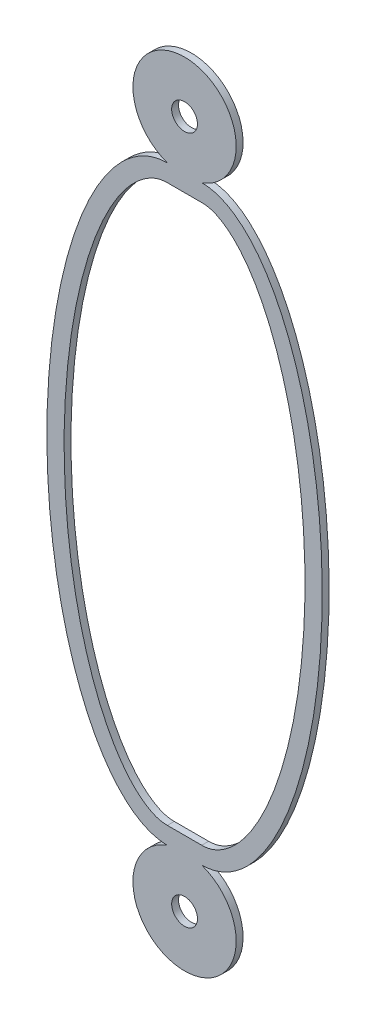
ISO-10303-21;
HEADER;
FILE_DESCRIPTION(('STEP AP214'),'2;1');
FILE_NAME('part.step','',(''),(''),'','','');
FILE_SCHEMA(('AUTOMOTIVE_DESIGN { 1 0 10303 214 1 1 1 1 }'));
ENDSEC;
DATA;
#1=APPLICATION_CONTEXT('core data for automotive mechanical design processes');
#2=APPLICATION_PROTOCOL_DEFINITION('international standard','automotive_design',2000,#1);
#3=PRODUCT_CONTEXT('',#1,'mechanical');
#4=PRODUCT('Part','Part','',(#3));
#5=PRODUCT_RELATED_PRODUCT_CATEGORY('part','',(#4));
#6=PRODUCT_DEFINITION_FORMATION('','',#4);
#7=PRODUCT_DEFINITION_CONTEXT('part definition',#1,'design');
#8=PRODUCT_DEFINITION('design','',#6,#7);
#9=PRODUCT_DEFINITION_SHAPE('','',#8);
#10=(LENGTH_UNIT() NAMED_UNIT(*) SI_UNIT(.MILLI.,.METRE.));
#11=(NAMED_UNIT(*) PLANE_ANGLE_UNIT() SI_UNIT($,.RADIAN.));
#12=(NAMED_UNIT(*) SI_UNIT($,.STERADIAN.) SOLID_ANGLE_UNIT());
#13=UNCERTAINTY_MEASURE_WITH_UNIT(LENGTH_MEASURE(1.E-05),#10,'distance_accuracy_value','');
#14=(GEOMETRIC_REPRESENTATION_CONTEXT(3) GLOBAL_UNCERTAINTY_ASSIGNED_CONTEXT((#13)) GLOBAL_UNIT_ASSIGNED_CONTEXT((#10,
#11,#12)) REPRESENTATION_CONTEXT('',''));
#15=CARTESIAN_POINT('',(0.,0.,0.));
#16=DIRECTION('',(0.,0.,1.));
#17=DIRECTION('',(1.,0.,0.));
#18=AXIS2_PLACEMENT_3D('',#15,#16,#17);
#19=CARTESIAN_POINT('',(-0.500000000000001,0.,0.1));
#20=DIRECTION('',(0.,0.,1.));
#21=DIRECTION('',(1.,0.,0.));
#22=AXIS2_PLACEMENT_3D('',#19,#20,#21);
#23=PLANE('',#22);
#24=CARTESIAN_POINT('',(0.,10.,0.1));
#25=DIRECTION('',(0.,0.,1.));
#26=DIRECTION('',(1.,0.,0.));
#27=AXIS2_PLACEMENT_3D('',#24,#25,#26);
#28=CIRCLE('',#27,0.375000000000001);
#29=CARTESIAN_POINT('',(0.375,10.,0.1));
#30=VERTEX_POINT('',#29);
#31=EDGE_CURVE('E182',#30,#30,#28,.T.);
#32=ORIENTED_EDGE('',*,*,#31,.F.);
#33=EDGE_LOOP('',(#32));
#34=FACE_BOUND('',#33,.T.);
#35=CARTESIAN_POINT('',(-0.500000000000001,0.,0.1));
#36=DIRECTION('',(0.,0.,1.));
#37=DIRECTION('',(0.,1.,0.));
#38=AXIS2_PLACEMENT_3D('',#35,#36,#37);
#39=ELLIPSE('',#38,8.5857864376269,3.5);
#40=CARTESIAN_POINT('',(-0.500000000000002,8.5857864376269,0.1));
#41=VERTEX_POINT('',#40);
#42=CARTESIAN_POINT('',(-0.500000000000001,-8.5857864376269,0.1));
#43=VERTEX_POINT('',#42);
#44=EDGE_CURVE('E188',#41,#43,#39,.T.);
#45=ORIENTED_EDGE('',*,*,#44,.T.);
#46=CARTESIAN_POINT('',(0.,-10.,0.1));
#47=DIRECTION('',(0.,0.,1.));
#48=DIRECTION('',(1.,0.,0.));
#49=AXIS2_PLACEMENT_3D('',#46,#47,#48);
#50=CIRCLE('',#49,1.5);
#51=CARTESIAN_POINT('',(0.499999999999999,-8.5857864376269,0.1));
#52=VERTEX_POINT('',#51);
#53=EDGE_CURVE('E175',#43,#52,#50,.T.);
#54=ORIENTED_EDGE('',*,*,#53,.T.);
#55=CARTESIAN_POINT('',(0.499999999999999,0.,0.1));
#56=DIRECTION('',(0.,0.,1.));
#57=DIRECTION('',(0.,1.,0.));
#58=AXIS2_PLACEMENT_3D('',#55,#56,#57);
#59=ELLIPSE('',#58,8.5857864376269,3.5);
#60=CARTESIAN_POINT('',(0.499999999999999,8.5857864376269,0.1));
#61=VERTEX_POINT('',#60);
#62=EDGE_CURVE('E170',#52,#61,#59,.T.);
#63=ORIENTED_EDGE('',*,*,#62,.T.);
#64=CARTESIAN_POINT('',(0.,10.,0.1));
#65=DIRECTION('',(0.,0.,1.));
#66=DIRECTION('',(1.,0.,0.));
#67=AXIS2_PLACEMENT_3D('',#64,#65,#66);
#68=CIRCLE('',#67,1.5);
#69=EDGE_CURVE('E174',#61,#41,#68,.T.);
#70=ORIENTED_EDGE('',*,*,#69,.T.);
#71=EDGE_LOOP('',(#45,#54,#63,#70));
#72=FACE_BOUND('',#71,.T.);
#73=CARTESIAN_POINT('',(0.,-10.,0.1));
#74=DIRECTION('',(0.,0.,1.));
#75=DIRECTION('',(1.,0.,0.));
#76=AXIS2_PLACEMENT_3D('',#73,#74,#75);
#77=CIRCLE('',#76,0.375);
#78=CARTESIAN_POINT('',(0.375000000000006,-10.,0.1));
#79=VERTEX_POINT('',#78);
#80=EDGE_CURVE('E215',#79,#79,#77,.T.);
#81=ORIENTED_EDGE('',*,*,#80,.F.);
#82=EDGE_LOOP('',(#81));
#83=FACE_BOUND('',#82,.T.);
#84=DIRECTION('',(1.,0.,0.));
#85=VECTOR('',#84,1.);
#86=CARTESIAN_POINT('',(-0.500000000000001,-8.08578643762691,0.1));
#87=LINE('',#86,#85);
#88=CARTESIAN_POINT('',(-0.500000000000001,-8.08578643762691,0.1));
#89=VERTEX_POINT('',#88);
#90=CARTESIAN_POINT('',(0.5,-8.0857864376269,0.1));
#91=VERTEX_POINT('',#90);
#92=EDGE_CURVE('E108',#89,#91,#87,.T.);
#93=ORIENTED_EDGE('',*,*,#92,.F.);
#94=CARTESIAN_POINT('',(-0.500000000000001,8.0857864376269,0.1));
#95=CARTESIAN_POINT('',(-0.659147925726962,8.0857864376269,0.1));
#96=CARTESIAN_POINT('',(-0.94590993674264,8.01836726312393,0.1));
#97=CARTESIAN_POINT('',(-1.48190681272366,7.63575974394931,0.1));
#98=CARTESIAN_POINT('',(-2.02462270649366,6.92767469065392,0.1));
#99=CARTESIAN_POINT('',(-2.69255409919081,5.58946200738258,0.1));
#100=CARTESIAN_POINT('',(-3.32190291475356,3.2913111898813,0.1));
#101=CARTESIAN_POINT('',(-3.58904854262322,0.,0.1));
#102=CARTESIAN_POINT('',(-3.32190291475355,-3.2913111898813,0.1));
#103=CARTESIAN_POINT('',(-2.69255409919081,-5.58946200738258,0.1));
#104=CARTESIAN_POINT('',(-2.02462270649366,-6.92767469065392,0.1));
#105=CARTESIAN_POINT('',(-1.48190681272366,-7.63575974394932,0.1));
#106=CARTESIAN_POINT('',(-0.945909936742641,-8.01836726312393,0.1));
#107=CARTESIAN_POINT('',(-0.659147925726963,-8.08578643762691,0.1));
#108=CARTESIAN_POINT('',(-0.500000000000001,-8.08578643762691,0.1));
#109=B_SPLINE_CURVE_WITH_KNOTS('',3,(#94,#95,#96,#97,#98,#99,#100,#101,#102,#103,#104,#105,#106,
#107,#108),.UNSPECIFIED.,.F.,.F.,(4,1,1,1,1,1,1,1,1,1,1,1,4),(0.,0.196349540849362,
0.392699081698724,0.589048622548086,0.785398163397448,1.17809724509617,1.5707963267949,
1.96349540849362,2.35619449019234,2.55254403104171,2.74889357189107,2.94524311274043,
3.14159265358979),.UNSPECIFIED.);
#110=CARTESIAN_POINT('',(-0.500000000000001,8.0857864376269,0.1));
#111=VERTEX_POINT('',#110);
#112=EDGE_CURVE('E100',#111,#89,#109,.T.);
#113=ORIENTED_EDGE('',*,*,#112,.F.);
#114=DIRECTION('',(-1.,0.,0.));
#115=VECTOR('',#114,1.);
#116=CARTESIAN_POINT('',(-0.500000000000001,8.0857864376269,0.1));
#117=LINE('',#116,#115);
#118=CARTESIAN_POINT('',(0.5,8.0857864376269,0.1));
#119=VERTEX_POINT('',#118);
#120=EDGE_CURVE('E122',#119,#111,#117,.T.);
#121=ORIENTED_EDGE('',*,*,#120,.F.);
#122=CARTESIAN_POINT('',(0.5,-8.0857864376269,0.1));
#123=CARTESIAN_POINT('',(0.659147925726961,-8.0857864376269,0.1));
#124=CARTESIAN_POINT('',(0.94590993674264,-8.01836726312392,0.1));
#125=CARTESIAN_POINT('',(1.48190681272366,-7.63575974394931,0.1));
#126=CARTESIAN_POINT('',(2.02462270649366,-6.92767469065392,0.1));
#127=CARTESIAN_POINT('',(2.69255409919081,-5.58946200738257,0.1));
#128=CARTESIAN_POINT('',(3.32190291475355,-3.2913111898813,0.1));
#129=CARTESIAN_POINT('',(3.58904854262322,0.,0.1));
#130=CARTESIAN_POINT('',(3.32190291475355,3.2913111898813,0.1));
#131=CARTESIAN_POINT('',(2.6925540991908,5.58946200738258,0.1));
#132=CARTESIAN_POINT('',(2.02462270649366,6.92767469065392,0.1));
#133=CARTESIAN_POINT('',(1.48190681272366,7.63575974394931,0.1));
#134=CARTESIAN_POINT('',(0.945909936742639,8.01836726312393,0.1));
#135=CARTESIAN_POINT('',(0.659147925726961,8.0857864376269,0.1));
#136=CARTESIAN_POINT('',(0.499999999999999,8.0857864376269,0.1));
#137=B_SPLINE_CURVE_WITH_KNOTS('',3,(#122,#123,#124,#125,#126,#127,#128,#129,#130,#131,#132,
#133,#134,#135,#136),.UNSPECIFIED.,.F.,.F.,(4,1,1,1,1,1,1,1,1,1,1,1,4),(-3.14159265358979,
-2.94524311274043,-2.74889357189107,-2.55254403104171,-2.35619449019234,-1.96349540849362,
-1.5707963267949,-1.17809724509617,-0.785398163397448,-0.589048622548086,-0.392699081698724,
-0.196349540849362,0.),.UNSPECIFIED.);
#138=EDGE_CURVE('E120',#91,#119,#137,.T.);
#139=ORIENTED_EDGE('',*,*,#138,.F.);
#140=EDGE_LOOP('',(#93,#113,#121,#139));
#141=FACE_BOUND('',#140,.T.);
#142=ADVANCED_FACE('F34',(#34,#72,#83,#141),#23,.T.);
#143=CARTESIAN_POINT('',(-0.500000000000001,0.,-0.1));
#144=DIRECTION('',(0.,0.,1.));
#145=DIRECTION('',(1.,0.,0.));
#146=AXIS2_PLACEMENT_3D('',#143,#144,#145);
#147=PLANE('',#146);
#148=CARTESIAN_POINT('',(0.,-10.,-0.1));
#149=DIRECTION('',(0.,0.,1.));
#150=DIRECTION('',(1.,0.,0.));
#151=AXIS2_PLACEMENT_3D('',#148,#149,#150);
#152=CIRCLE('',#151,0.375);
#153=CARTESIAN_POINT('',(0.375000000000006,-10.,-0.1));
#154=VERTEX_POINT('',#153);
#155=EDGE_CURVE('E116',#154,#154,#152,.T.);
#156=ORIENTED_EDGE('',*,*,#155,.T.);
#157=EDGE_LOOP('',(#156));
#158=FACE_BOUND('',#157,.T.);
#159=CARTESIAN_POINT('',(0.,10.,-0.1));
#160=DIRECTION('',(0.,0.,1.));
#161=DIRECTION('',(1.,0.,0.));
#162=AXIS2_PLACEMENT_3D('',#159,#160,#161);
#163=CIRCLE('',#162,0.375000000000001);
#164=CARTESIAN_POINT('',(0.375,10.,-0.1));
#165=VERTEX_POINT('',#164);
#166=EDGE_CURVE('E212',#165,#165,#163,.T.);
#167=ORIENTED_EDGE('',*,*,#166,.T.);
#168=EDGE_LOOP('',(#167));
#169=FACE_BOUND('',#168,.T.);
#170=CARTESIAN_POINT('',(-0.500000000000001,0.,-0.1));
#171=DIRECTION('',(0.,0.,1.));
#172=DIRECTION('',(0.,1.,0.));
#173=AXIS2_PLACEMENT_3D('',#170,#171,#172);
#174=ELLIPSE('',#173,8.5857864376269,3.5);
#175=CARTESIAN_POINT('',(-0.500000000000002,8.5857864376269,-0.1));
#176=VERTEX_POINT('',#175);
#177=CARTESIAN_POINT('',(-0.500000000000001,-8.5857864376269,-0.1));
#178=VERTEX_POINT('',#177);
#179=EDGE_CURVE('E178',#176,#178,#174,.T.);
#180=ORIENTED_EDGE('',*,*,#179,.F.);
#181=CARTESIAN_POINT('',(0.,10.,-0.1));
#182=DIRECTION('',(0.,0.,1.));
#183=DIRECTION('',(1.,0.,0.));
#184=AXIS2_PLACEMENT_3D('',#181,#182,#183);
#185=CIRCLE('',#184,1.5);
#186=CARTESIAN_POINT('',(0.499999999999999,8.5857864376269,-0.1));
#187=VERTEX_POINT('',#186);
#188=EDGE_CURVE('E186',#187,#176,#185,.T.);
#189=ORIENTED_EDGE('',*,*,#188,.F.);
#190=CARTESIAN_POINT('',(0.499999999999999,0.,-0.1));
#191=DIRECTION('',(0.,0.,1.));
#192=DIRECTION('',(0.,1.,0.));
#193=AXIS2_PLACEMENT_3D('',#190,#191,#192);
#194=ELLIPSE('',#193,8.5857864376269,3.5);
#195=CARTESIAN_POINT('',(0.499999999999999,-8.5857864376269,-0.1));
#196=VERTEX_POINT('',#195);
#197=EDGE_CURVE('E184',#196,#187,#194,.T.);
#198=ORIENTED_EDGE('',*,*,#197,.F.);
#199=CARTESIAN_POINT('',(0.,-10.,-0.1));
#200=DIRECTION('',(0.,0.,1.));
#201=DIRECTION('',(1.,0.,0.));
#202=AXIS2_PLACEMENT_3D('',#199,#200,#201);
#203=CIRCLE('',#202,1.5);
#204=EDGE_CURVE('E181',#178,#196,#203,.T.);
#205=ORIENTED_EDGE('',*,*,#204,.F.);
#206=EDGE_LOOP('',(#180,#189,#198,#205));
#207=FACE_BOUND('',#206,.T.);
#208=CARTESIAN_POINT('',(-0.500000000000001,8.0857864376269,-0.1));
#209=CARTESIAN_POINT('',(-0.659147925726962,8.0857864376269,-0.1));
#210=CARTESIAN_POINT('',(-0.94590993674264,8.01836726312393,-0.1));
#211=CARTESIAN_POINT('',(-1.48190681272366,7.63575974394931,-0.1));
#212=CARTESIAN_POINT('',(-2.02462270649366,6.92767469065392,-0.1));
#213=CARTESIAN_POINT('',(-2.69255409919081,5.58946200738258,-0.1));
#214=CARTESIAN_POINT('',(-3.32190291475356,3.2913111898813,-0.1));
#215=CARTESIAN_POINT('',(-3.58904854262322,0.,-0.1));
#216=CARTESIAN_POINT('',(-3.32190291475355,-3.2913111898813,-0.1));
#217=CARTESIAN_POINT('',(-2.69255409919081,-5.58946200738258,-0.1));
#218=CARTESIAN_POINT('',(-2.02462270649366,-6.92767469065392,-0.1));
#219=CARTESIAN_POINT('',(-1.48190681272366,-7.63575974394932,-0.1));
#220=CARTESIAN_POINT('',(-0.945909936742641,-8.01836726312393,-0.1));
#221=CARTESIAN_POINT('',(-0.659147925726963,-8.08578643762691,-0.1));
#222=CARTESIAN_POINT('',(-0.500000000000001,-8.08578643762691,-0.1));
#223=B_SPLINE_CURVE_WITH_KNOTS('',3,(#208,#209,#210,#211,#212,#213,#214,#215,#216,#217,#218,
#219,#220,#221,#222),.UNSPECIFIED.,.F.,.F.,(4,1,1,1,1,1,1,1,1,1,1,1,4),(0.,0.196349540849362,
0.392699081698724,0.589048622548086,0.785398163397448,1.17809724509617,1.5707963267949,
1.96349540849362,2.35619449019234,2.55254403104171,2.74889357189107,2.94524311274043,
3.14159265358979),.UNSPECIFIED.);
#224=CARTESIAN_POINT('',(-0.500000000000001,8.0857864376269,-0.1));
#225=VERTEX_POINT('',#224);
#226=CARTESIAN_POINT('',(-0.500000000000001,-8.08578643762691,-0.1));
#227=VERTEX_POINT('',#226);
#228=EDGE_CURVE('E58',#225,#227,#223,.T.);
#229=ORIENTED_EDGE('',*,*,#228,.T.);
#230=DIRECTION('',(1.,0.,0.));
#231=VECTOR('',#230,1.);
#232=CARTESIAN_POINT('',(-0.500000000000001,-8.08578643762691,-0.1));
#233=LINE('',#232,#231);
#234=CARTESIAN_POINT('',(0.5,-8.0857864376269,-0.1));
#235=VERTEX_POINT('',#234);
#236=EDGE_CURVE('E115',#227,#235,#233,.T.);
#237=ORIENTED_EDGE('',*,*,#236,.T.);
#238=CARTESIAN_POINT('',(0.5,-8.0857864376269,-0.1));
#239=CARTESIAN_POINT('',(0.659147925726961,-8.0857864376269,-0.1));
#240=CARTESIAN_POINT('',(0.94590993674264,-8.01836726312392,-0.1));
#241=CARTESIAN_POINT('',(1.48190681272366,-7.63575974394931,-0.1));
#242=CARTESIAN_POINT('',(2.02462270649366,-6.92767469065392,-0.1));
#243=CARTESIAN_POINT('',(2.69255409919081,-5.58946200738257,-0.1));
#244=CARTESIAN_POINT('',(3.32190291475355,-3.2913111898813,-0.1));
#245=CARTESIAN_POINT('',(3.58904854262322,0.,-0.1));
#246=CARTESIAN_POINT('',(3.32190291475355,3.2913111898813,-0.1));
#247=CARTESIAN_POINT('',(2.6925540991908,5.58946200738258,-0.1));
#248=CARTESIAN_POINT('',(2.02462270649366,6.92767469065392,-0.1));
#249=CARTESIAN_POINT('',(1.48190681272366,7.63575974394931,-0.1));
#250=CARTESIAN_POINT('',(0.945909936742639,8.01836726312393,-0.1));
#251=CARTESIAN_POINT('',(0.659147925726961,8.0857864376269,-0.1));
#252=CARTESIAN_POINT('',(0.499999999999999,8.0857864376269,-0.1));
#253=B_SPLINE_CURVE_WITH_KNOTS('',3,(#238,#239,#240,#241,#242,#243,#244,#245,#246,#247,#248,
#249,#250,#251,#252),.UNSPECIFIED.,.F.,.F.,(4,1,1,1,1,1,1,1,1,1,1,1,4),(-3.14159265358979,
-2.94524311274043,-2.74889357189107,-2.55254403104171,-2.35619449019234,-1.96349540849362,
-1.5707963267949,-1.17809724509617,-0.785398163397448,-0.589048622548086,-0.392699081698724,
-0.196349540849362,0.),.UNSPECIFIED.);
#254=CARTESIAN_POINT('',(0.499999999999999,8.0857864376269,-0.1));
#255=VERTEX_POINT('',#254);
#256=EDGE_CURVE('E227',#235,#255,#253,.T.);
#257=ORIENTED_EDGE('',*,*,#256,.T.);
#258=DIRECTION('',(-1.,0.,0.));
#259=VECTOR('',#258,1.);
#260=CARTESIAN_POINT('',(-0.500000000000001,8.0857864376269,-0.1));
#261=LINE('',#260,#259);
#262=EDGE_CURVE('E109',#255,#225,#261,.T.);
#263=ORIENTED_EDGE('',*,*,#262,.T.);
#264=EDGE_LOOP('',(#229,#237,#257,#263));
#265=FACE_BOUND('',#264,.T.);
#266=ADVANCED_FACE('F157',(#158,#169,#207,#265),#147,.F.);
#267=DIRECTION('',(0.,0.,-1.));
#268=VECTOR('',#267,1.);
#269=SURFACE_OF_LINEAR_EXTRUSION('',#39,#268);
#270=ORIENTED_EDGE('',*,*,#179,.T.);
#271=DIRECTION('',(0.,0.,-1.));
#272=VECTOR('',#271,1.);
#273=CARTESIAN_POINT('',(-0.500000000000001,-8.5857864376269,0.1));
#274=LINE('',#273,#272);
#275=EDGE_CURVE('E11',#43,#178,#274,.T.);
#276=ORIENTED_EDGE('',*,*,#275,.F.);
#277=ORIENTED_EDGE('',*,*,#44,.F.);
#278=DIRECTION('',(0.,0.,-1.));
#279=VECTOR('',#278,1.);
#280=CARTESIAN_POINT('',(-0.500000000000002,8.5857864376269,0.1));
#281=LINE('',#280,#279);
#282=EDGE_CURVE('E177',#41,#176,#281,.T.);
#283=ORIENTED_EDGE('',*,*,#282,.T.);
#284=EDGE_LOOP('',(#270,#276,#277,#283));
#285=FACE_BOUND('',#284,.T.);
#286=ADVANCED_FACE('F36',(#285),#269,.F.);
#287=CARTESIAN_POINT('',(0.,-10.,0.1));
#288=DIRECTION('',(0.,0.,-1.));
#289=DIRECTION('',(-1.,0.,0.));
#290=AXIS2_PLACEMENT_3D('',#287,#288,#289);
#291=CYLINDRICAL_SURFACE('',#290,1.5);
#292=ORIENTED_EDGE('',*,*,#204,.T.);
#293=DIRECTION('',(0.,0.,-1.));
#294=VECTOR('',#293,1.);
#295=CARTESIAN_POINT('',(0.499999999999999,-8.5857864376269,0.1));
#296=LINE('',#295,#294);
#297=EDGE_CURVE('E43',#52,#196,#296,.T.);
#298=ORIENTED_EDGE('',*,*,#297,.F.);
#299=ORIENTED_EDGE('',*,*,#53,.F.);
#300=ORIENTED_EDGE('',*,*,#275,.T.);
#301=EDGE_LOOP('',(#292,#298,#299,#300));
#302=FACE_BOUND('',#301,.T.);
#303=ADVANCED_FACE('F168',(#302),#291,.T.);
#304=DIRECTION('',(0.,0.,-1.));
#305=VECTOR('',#304,1.);
#306=SURFACE_OF_LINEAR_EXTRUSION('',#59,#305);
#307=ORIENTED_EDGE('',*,*,#197,.T.);
#308=DIRECTION('',(0.,0.,-1.));
#309=VECTOR('',#308,1.);
#310=CARTESIAN_POINT('',(0.499999999999999,8.5857864376269,0.1));
#311=LINE('',#310,#309);
#312=EDGE_CURVE('E191',#61,#187,#311,.T.);
#313=ORIENTED_EDGE('',*,*,#312,.F.);
#314=ORIENTED_EDGE('',*,*,#62,.F.);
#315=ORIENTED_EDGE('',*,*,#297,.T.);
#316=EDGE_LOOP('',(#307,#313,#314,#315));
#317=FACE_BOUND('',#316,.T.);
#318=ADVANCED_FACE('F164',(#317),#306,.F.);
#319=CARTESIAN_POINT('',(0.,10.,0.1));
#320=DIRECTION('',(0.,0.,-1.));
#321=DIRECTION('',(-1.,0.,0.));
#322=AXIS2_PLACEMENT_3D('',#319,#320,#321);
#323=CYLINDRICAL_SURFACE('',#322,1.5);
#324=ORIENTED_EDGE('',*,*,#188,.T.);
#325=ORIENTED_EDGE('',*,*,#282,.F.);
#326=ORIENTED_EDGE('',*,*,#69,.F.);
#327=ORIENTED_EDGE('',*,*,#312,.T.);
#328=EDGE_LOOP('',(#324,#325,#326,#327));
#329=FACE_BOUND('',#328,.T.);
#330=ADVANCED_FACE('F153',(#329),#323,.T.);
#331=CARTESIAN_POINT('',(0.,10.,0.1));
#332=DIRECTION('',(0.,0.,-1.));
#333=DIRECTION('',(-1.,0.,0.));
#334=AXIS2_PLACEMENT_3D('',#331,#332,#333);
#335=CYLINDRICAL_SURFACE('',#334,0.375000000000001);
#336=ORIENTED_EDGE('',*,*,#31,.T.);
#337=EDGE_LOOP('',(#336));
#338=FACE_BOUND('',#337,.T.);
#339=ORIENTED_EDGE('',*,*,#166,.F.);
#340=EDGE_LOOP('',(#339));
#341=FACE_BOUND('',#340,.T.);
#342=ADVANCED_FACE('F149',(#338,#341),#335,.F.);
#343=CARTESIAN_POINT('',(0.,-10.,0.1));
#344=DIRECTION('',(0.,0.,-1.));
#345=DIRECTION('',(-1.,0.,0.));
#346=AXIS2_PLACEMENT_3D('',#343,#344,#345);
#347=CYLINDRICAL_SURFACE('',#346,0.375);
#348=ORIENTED_EDGE('',*,*,#80,.T.);
#349=EDGE_LOOP('',(#348));
#350=FACE_BOUND('',#349,.T.);
#351=ORIENTED_EDGE('',*,*,#155,.F.);
#352=EDGE_LOOP('',(#351));
#353=FACE_BOUND('',#352,.T.);
#354=ADVANCED_FACE('F146',(#350,#353),#347,.F.);
#355=DIRECTION('',(0.,0.,-1.));
#356=VECTOR('',#355,1.);
#357=SURFACE_OF_LINEAR_EXTRUSION('',#109,#356);
#358=ORIENTED_EDGE('',*,*,#228,.F.);
#359=DIRECTION('',(0.,0.,-1.));
#360=VECTOR('',#359,1.);
#361=CARTESIAN_POINT('',(-0.500000000000001,8.0857864376269,0.1));
#362=LINE('',#361,#360);
#363=EDGE_CURVE('E104',#111,#225,#362,.T.);
#364=ORIENTED_EDGE('',*,*,#363,.F.);
#365=ORIENTED_EDGE('',*,*,#112,.T.);
#366=DIRECTION('',(0.,0.,-1.));
#367=VECTOR('',#366,1.);
#368=CARTESIAN_POINT('',(-0.500000000000001,-8.08578643762691,0.1));
#369=LINE('',#368,#367);
#370=EDGE_CURVE('E103',#89,#227,#369,.T.);
#371=ORIENTED_EDGE('',*,*,#370,.T.);
#372=EDGE_LOOP('',(#358,#364,#365,#371));
#373=FACE_BOUND('',#372,.T.);
#374=ADVANCED_FACE('F102',(#373),#357,.T.);
#375=CARTESIAN_POINT('',(-0.500000000000001,-8.08578643762691,0.1));
#376=DIRECTION('',(0.,1.,0.));
#377=DIRECTION('',(-1.,0.,0.));
#378=AXIS2_PLACEMENT_3D('',#375,#376,#377);
#379=PLANE('',#378);
#380=ORIENTED_EDGE('',*,*,#236,.F.);
#381=ORIENTED_EDGE('',*,*,#370,.F.);
#382=ORIENTED_EDGE('',*,*,#92,.T.);
#383=DIRECTION('',(0.,0.,-1.));
#384=VECTOR('',#383,1.);
#385=CARTESIAN_POINT('',(0.5,-8.0857864376269,0.1));
#386=LINE('',#385,#384);
#387=EDGE_CURVE('E117',#91,#235,#386,.T.);
#388=ORIENTED_EDGE('',*,*,#387,.T.);
#389=EDGE_LOOP('',(#380,#381,#382,#388));
#390=FACE_BOUND('',#389,.T.);
#391=ADVANCED_FACE('F112',(#390),#379,.T.);
#392=DIRECTION('',(0.,0.,-1.));
#393=VECTOR('',#392,1.);
#394=SURFACE_OF_LINEAR_EXTRUSION('',#137,#393);
#395=ORIENTED_EDGE('',*,*,#256,.F.);
#396=ORIENTED_EDGE('',*,*,#387,.F.);
#397=ORIENTED_EDGE('',*,*,#138,.T.);
#398=DIRECTION('',(0.,0.,-1.));
#399=VECTOR('',#398,1.);
#400=CARTESIAN_POINT('',(0.499999999999999,8.0857864376269,0.1));
#401=LINE('',#400,#399);
#402=EDGE_CURVE('E50',#119,#255,#401,.T.);
#403=ORIENTED_EDGE('',*,*,#402,.T.);
#404=EDGE_LOOP('',(#395,#396,#397,#403));
#405=FACE_BOUND('',#404,.T.);
#406=ADVANCED_FACE('F136',(#405),#394,.T.);
#407=CARTESIAN_POINT('',(-0.500000000000001,8.0857864376269,0.1));
#408=DIRECTION('',(0.,-1.,0.));
#409=DIRECTION('',(0.,0.,-1.));
#410=AXIS2_PLACEMENT_3D('',#407,#408,#409);
#411=PLANE('',#410);
#412=ORIENTED_EDGE('',*,*,#262,.F.);
#413=ORIENTED_EDGE('',*,*,#402,.F.);
#414=ORIENTED_EDGE('',*,*,#120,.T.);
#415=ORIENTED_EDGE('',*,*,#363,.T.);
#416=EDGE_LOOP('',(#412,#413,#414,#415));
#417=FACE_BOUND('',#416,.T.);
#418=ADVANCED_FACE('F140',(#417),#411,.T.);
#419=CLOSED_SHELL('',(#142,#266,#286,#303,#318,#330,#342,#354,#374,#391,#406,#418));
#420=MANIFOLD_SOLID_BREP('B2',#419);
#421=ADVANCED_BREP_SHAPE_REPRESENTATION('',(#18,#420),#14);
#422=SHAPE_DEFINITION_REPRESENTATION(#9,#421);
ENDSEC;
END-ISO-10303-21;
